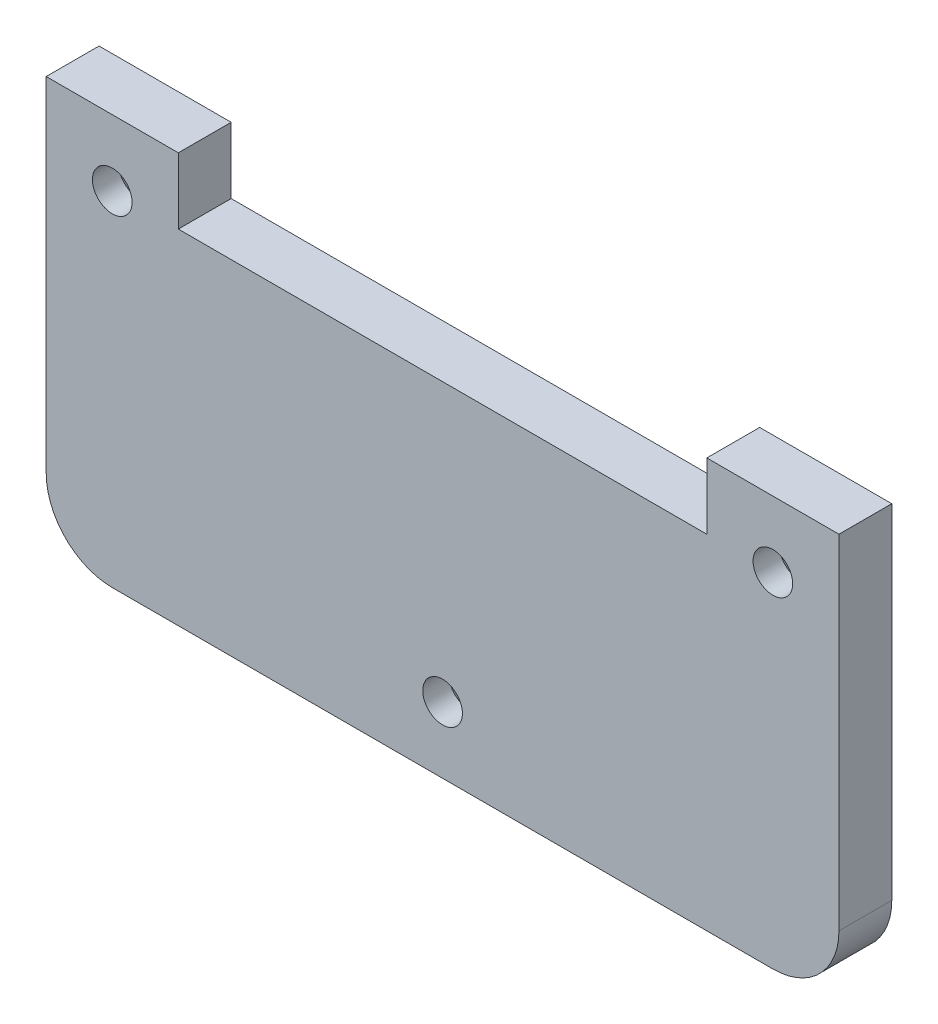
ISO-10303-21;
HEADER;
FILE_DESCRIPTION(('STEP AP214'),'2;1');
FILE_NAME('part.step','',(''),(''),'','','');
FILE_SCHEMA(('AUTOMOTIVE_DESIGN { 1 0 10303 214 1 1 1 1 }'));
ENDSEC;
DATA;
#1=APPLICATION_CONTEXT('core data for automotive mechanical design processes');
#2=APPLICATION_PROTOCOL_DEFINITION('international standard','automotive_design',2000,#1);
#3=PRODUCT_CONTEXT('',#1,'mechanical');
#4=PRODUCT('Part','Part','',(#3));
#5=PRODUCT_RELATED_PRODUCT_CATEGORY('part','',(#4));
#6=PRODUCT_DEFINITION_FORMATION('','',#4);
#7=PRODUCT_DEFINITION_CONTEXT('part definition',#1,'design');
#8=PRODUCT_DEFINITION('design','',#6,#7);
#9=PRODUCT_DEFINITION_SHAPE('','',#8);
#10=(LENGTH_UNIT() NAMED_UNIT(*) SI_UNIT(.MILLI.,.METRE.));
#11=(NAMED_UNIT(*) PLANE_ANGLE_UNIT() SI_UNIT($,.RADIAN.));
#12=(NAMED_UNIT(*) SI_UNIT($,.STERADIAN.) SOLID_ANGLE_UNIT());
#13=UNCERTAINTY_MEASURE_WITH_UNIT(LENGTH_MEASURE(1.E-05),#10,'distance_accuracy_value','');
#14=(GEOMETRIC_REPRESENTATION_CONTEXT(3) GLOBAL_UNCERTAINTY_ASSIGNED_CONTEXT((#13)) GLOBAL_UNIT_ASSIGNED_CONTEXT((#10,
#11,#12)) REPRESENTATION_CONTEXT('',''));
#15=CARTESIAN_POINT('',(0.,0.,0.));
#16=DIRECTION('',(0.,0.,1.));
#17=DIRECTION('',(1.,0.,0.));
#18=AXIS2_PLACEMENT_3D('',#15,#16,#17);
#19=CARTESIAN_POINT('',(5.,-26.,4.));
#20=DIRECTION('',(0.,0.,-1.));
#21=DIRECTION('',(-1.,0.,0.));
#22=AXIS2_PLACEMENT_3D('',#19,#20,#21);
#23=CYLINDRICAL_SURFACE('',#22,5.);
#24=CARTESIAN_POINT('',(5.,-26.,0.));
#25=DIRECTION('',(0.,0.,1.));
#26=DIRECTION('',(1.,0.,0.));
#27=AXIS2_PLACEMENT_3D('',#24,#25,#26);
#28=CIRCLE('',#27,5.);
#29=CARTESIAN_POINT('',(5.00000000000004,-31.,0.));
#30=VERTEX_POINT('',#29);
#31=CARTESIAN_POINT('',(0.,-26.,0.));
#32=VERTEX_POINT('',#31);
#33=EDGE_CURVE('E176',#30,#32,#28,.F.);
#34=ORIENTED_EDGE('',*,*,#33,.F.);
#35=DIRECTION('',(0.,0.,-1.));
#36=VECTOR('',#35,1.);
#37=CARTESIAN_POINT('',(5.00000000000004,-31.,4.));
#38=LINE('',#37,#36);
#39=CARTESIAN_POINT('',(5.00000000000004,-31.,4.));
#40=VERTEX_POINT('',#39);
#41=EDGE_CURVE('E104',#40,#30,#38,.T.);
#42=ORIENTED_EDGE('',*,*,#41,.F.);
#43=CARTESIAN_POINT('',(5.,-26.,4.));
#44=DIRECTION('',(0.,0.,1.));
#45=DIRECTION('',(1.,0.,0.));
#46=AXIS2_PLACEMENT_3D('',#43,#44,#45);
#47=CIRCLE('',#46,5.);
#48=CARTESIAN_POINT('',(0.,-26.,4.));
#49=VERTEX_POINT('',#48);
#50=EDGE_CURVE('E165',#40,#49,#47,.F.);
#51=ORIENTED_EDGE('',*,*,#50,.T.);
#52=DIRECTION('',(0.,0.,-1.));
#53=VECTOR('',#52,1.);
#54=CARTESIAN_POINT('',(0.,-26.,4.));
#55=LINE('',#54,#53);
#56=EDGE_CURVE('E100',#49,#32,#55,.T.);
#57=ORIENTED_EDGE('',*,*,#56,.T.);
#58=EDGE_LOOP('',(#34,#42,#51,#57));
#59=FACE_BOUND('',#58,.T.);
#60=ADVANCED_FACE('F41',(#59),#23,.T.);
#61=CARTESIAN_POINT('',(0.,-31.,4.));
#62=DIRECTION('',(0.,1.,0.));
#63=DIRECTION('',(0.,0.,1.));
#64=AXIS2_PLACEMENT_3D('',#61,#62,#63);
#65=PLANE('',#64);
#66=DIRECTION('',(1.,0.,0.));
#67=VECTOR('',#66,1.);
#68=CARTESIAN_POINT('',(0.,-31.,0.));
#69=LINE('',#68,#67);
#70=CARTESIAN_POINT('',(55.,-31.,0.));
#71=VERTEX_POINT('',#70);
#72=EDGE_CURVE('E180',#30,#71,#69,.T.);
#73=ORIENTED_EDGE('',*,*,#72,.T.);
#74=DIRECTION('',(0.,0.,-1.));
#75=VECTOR('',#74,1.);
#76=CARTESIAN_POINT('',(55.,-31.,4.));
#77=LINE('',#76,#75);
#78=CARTESIAN_POINT('',(55.,-31.,4.));
#79=VERTEX_POINT('',#78);
#80=EDGE_CURVE('E216',#79,#71,#77,.T.);
#81=ORIENTED_EDGE('',*,*,#80,.F.);
#82=DIRECTION('',(1.,0.,0.));
#83=VECTOR('',#82,1.);
#84=CARTESIAN_POINT('',(0.,-31.,4.));
#85=LINE('',#84,#83);
#86=EDGE_CURVE('E161',#40,#79,#85,.T.);
#87=ORIENTED_EDGE('',*,*,#86,.F.);
#88=ORIENTED_EDGE('',*,*,#41,.T.);
#89=EDGE_LOOP('',(#73,#81,#87,#88));
#90=FACE_BOUND('',#89,.T.);
#91=ADVANCED_FACE('F255',(#90),#65,.F.);
#92=CARTESIAN_POINT('',(55.,-26.,4.));
#93=DIRECTION('',(0.,0.,-1.));
#94=DIRECTION('',(-1.,0.,0.));
#95=AXIS2_PLACEMENT_3D('',#92,#93,#94);
#96=CYLINDRICAL_SURFACE('',#95,5.);
#97=CARTESIAN_POINT('',(55.,-26.,0.));
#98=DIRECTION('',(0.,0.,1.));
#99=DIRECTION('',(1.,0.,0.));
#100=AXIS2_PLACEMENT_3D('',#97,#98,#99);
#101=CIRCLE('',#100,5.);
#102=CARTESIAN_POINT('',(60.,-26.,0.));
#103=VERTEX_POINT('',#102);
#104=EDGE_CURVE('E185',#103,#71,#101,.F.);
#105=ORIENTED_EDGE('',*,*,#104,.F.);
#106=DIRECTION('',(0.,0.,-1.));
#107=VECTOR('',#106,1.);
#108=CARTESIAN_POINT('',(60.,-26.,4.));
#109=LINE('',#108,#107);
#110=CARTESIAN_POINT('',(60.,-26.,4.));
#111=VERTEX_POINT('',#110);
#112=EDGE_CURVE('E214',#111,#103,#109,.T.);
#113=ORIENTED_EDGE('',*,*,#112,.F.);
#114=CARTESIAN_POINT('',(55.,-26.,4.));
#115=DIRECTION('',(0.,0.,1.));
#116=DIRECTION('',(1.,0.,0.));
#117=AXIS2_PLACEMENT_3D('',#114,#115,#116);
#118=CIRCLE('',#117,5.);
#119=EDGE_CURVE('E157',#111,#79,#118,.F.);
#120=ORIENTED_EDGE('',*,*,#119,.T.);
#121=ORIENTED_EDGE('',*,*,#80,.T.);
#122=EDGE_LOOP('',(#105,#113,#120,#121));
#123=FACE_BOUND('',#122,.T.);
#124=ADVANCED_FACE('F260',(#123),#96,.T.);
#125=CARTESIAN_POINT('',(60.,0.,4.));
#126=DIRECTION('',(1.,0.,0.));
#127=DIRECTION('',(0.,0.,-1.));
#128=AXIS2_PLACEMENT_3D('',#125,#126,#127);
#129=PLANE('',#128);
#130=DIRECTION('',(0.,-1.,0.));
#131=VECTOR('',#130,1.);
#132=CARTESIAN_POINT('',(60.,0.,0.));
#133=LINE('',#132,#131);
#134=CARTESIAN_POINT('',(60.,0.,0.));
#135=VERTEX_POINT('',#134);
#136=EDGE_CURVE('E190',#135,#103,#133,.T.);
#137=ORIENTED_EDGE('',*,*,#136,.F.);
#138=DIRECTION('',(0.,0.,-1.));
#139=VECTOR('',#138,1.);
#140=CARTESIAN_POINT('',(60.,0.,4.));
#141=LINE('',#140,#139);
#142=CARTESIAN_POINT('',(60.,0.,4.));
#143=VERTEX_POINT('',#142);
#144=EDGE_CURVE('E212',#143,#135,#141,.T.);
#145=ORIENTED_EDGE('',*,*,#144,.F.);
#146=DIRECTION('',(0.,-1.,0.));
#147=VECTOR('',#146,1.);
#148=CARTESIAN_POINT('',(60.,0.,4.));
#149=LINE('',#148,#147);
#150=EDGE_CURVE('E153',#143,#111,#149,.T.);
#151=ORIENTED_EDGE('',*,*,#150,.T.);
#152=ORIENTED_EDGE('',*,*,#112,.T.);
#153=EDGE_LOOP('',(#137,#145,#151,#152));
#154=FACE_BOUND('',#153,.T.);
#155=ADVANCED_FACE('F317',(#154),#129,.T.);
#156=CARTESIAN_POINT('',(0.,0.,4.));
#157=DIRECTION('',(0.,1.,0.));
#158=DIRECTION('',(0.,0.,1.));
#159=AXIS2_PLACEMENT_3D('',#156,#157,#158);
#160=PLANE('',#159);
#161=DIRECTION('',(1.,0.,0.));
#162=VECTOR('',#161,1.);
#163=CARTESIAN_POINT('',(0.,0.,0.));
#164=LINE('',#163,#162);
#165=CARTESIAN_POINT('',(50.,0.,0.));
#166=VERTEX_POINT('',#165);
#167=EDGE_CURVE('E193',#166,#135,#164,.T.);
#168=ORIENTED_EDGE('',*,*,#167,.F.);
#169=DIRECTION('',(0.,0.,-1.));
#170=VECTOR('',#169,1.);
#171=CARTESIAN_POINT('',(50.,0.,4.));
#172=LINE('',#171,#170);
#173=CARTESIAN_POINT('',(50.,0.,4.));
#174=VERTEX_POINT('',#173);
#175=EDGE_CURVE('E210',#174,#166,#172,.T.);
#176=ORIENTED_EDGE('',*,*,#175,.F.);
#177=DIRECTION('',(1.,0.,0.));
#178=VECTOR('',#177,1.);
#179=CARTESIAN_POINT('',(0.,0.,4.));
#180=LINE('',#179,#178);
#181=EDGE_CURVE('E147',#174,#143,#180,.T.);
#182=ORIENTED_EDGE('',*,*,#181,.T.);
#183=ORIENTED_EDGE('',*,*,#144,.T.);
#184=EDGE_LOOP('',(#168,#176,#182,#183));
#185=FACE_BOUND('',#184,.T.);
#186=ADVANCED_FACE('F306',(#185),#160,.T.);
#187=CARTESIAN_POINT('',(50.,0.,4.));
#188=DIRECTION('',(1.,0.,0.));
#189=DIRECTION('',(0.,1.,0.));
#190=AXIS2_PLACEMENT_3D('',#187,#188,#189);
#191=PLANE('',#190);
#192=DIRECTION('',(0.,-1.,0.));
#193=VECTOR('',#192,1.);
#194=CARTESIAN_POINT('',(50.,0.,0.));
#195=LINE('',#194,#193);
#196=CARTESIAN_POINT('',(50.,-5.,0.));
#197=VERTEX_POINT('',#196);
#198=EDGE_CURVE('E196',#166,#197,#195,.T.);
#199=ORIENTED_EDGE('',*,*,#198,.T.);
#200=DIRECTION('',(0.,0.,-1.));
#201=VECTOR('',#200,1.);
#202=CARTESIAN_POINT('',(50.,-5.,4.));
#203=LINE('',#202,#201);
#204=CARTESIAN_POINT('',(50.,-5.,4.));
#205=VERTEX_POINT('',#204);
#206=EDGE_CURVE('E208',#205,#197,#203,.T.);
#207=ORIENTED_EDGE('',*,*,#206,.F.);
#208=DIRECTION('',(0.,-1.,0.));
#209=VECTOR('',#208,1.);
#210=CARTESIAN_POINT('',(50.,0.,4.));
#211=LINE('',#210,#209);
#212=EDGE_CURVE('E152',#174,#205,#211,.T.);
#213=ORIENTED_EDGE('',*,*,#212,.F.);
#214=ORIENTED_EDGE('',*,*,#175,.T.);
#215=EDGE_LOOP('',(#199,#207,#213,#214));
#216=FACE_BOUND('',#215,.T.);
#217=ADVANCED_FACE('F312',(#216),#191,.F.);
#218=CARTESIAN_POINT('',(0.,-5.00000000000002,4.));
#219=DIRECTION('',(0.,1.,0.));
#220=DIRECTION('',(-1.,0.,0.));
#221=AXIS2_PLACEMENT_3D('',#218,#219,#220);
#222=PLANE('',#221);
#223=DIRECTION('',(1.,0.,0.));
#224=VECTOR('',#223,1.);
#225=CARTESIAN_POINT('',(0.,-5.00000000000002,0.));
#226=LINE('',#225,#224);
#227=CARTESIAN_POINT('',(10.,-5.00000000000001,0.));
#228=VERTEX_POINT('',#227);
#229=EDGE_CURVE('E200',#228,#197,#226,.T.);
#230=ORIENTED_EDGE('',*,*,#229,.F.);
#231=DIRECTION('',(0.,0.,-1.));
#232=VECTOR('',#231,1.);
#233=CARTESIAN_POINT('',(10.,-5.00000000000001,4.));
#234=LINE('',#233,#232);
#235=CARTESIAN_POINT('',(10.,-5.00000000000001,4.));
#236=VERTEX_POINT('',#235);
#237=EDGE_CURVE('E137',#236,#228,#234,.T.);
#238=ORIENTED_EDGE('',*,*,#237,.F.);
#239=DIRECTION('',(1.,0.,0.));
#240=VECTOR('',#239,1.);
#241=CARTESIAN_POINT('',(0.,-5.00000000000002,4.));
#242=LINE('',#241,#240);
#243=EDGE_CURVE('E143',#236,#205,#242,.T.);
#244=ORIENTED_EDGE('',*,*,#243,.T.);
#245=ORIENTED_EDGE('',*,*,#206,.T.);
#246=EDGE_LOOP('',(#230,#238,#244,#245));
#247=FACE_BOUND('',#246,.T.);
#248=ADVANCED_FACE('F309',(#247),#222,.T.);
#249=CARTESIAN_POINT('',(10.,0.,4.));
#250=DIRECTION('',(1.,0.,0.));
#251=DIRECTION('',(0.,1.,0.));
#252=AXIS2_PLACEMENT_3D('',#249,#250,#251);
#253=PLANE('',#252);
#254=DIRECTION('',(0.,-1.,0.));
#255=VECTOR('',#254,1.);
#256=CARTESIAN_POINT('',(10.,0.,0.));
#257=LINE('',#256,#255);
#258=CARTESIAN_POINT('',(10.,0.,0.));
#259=VERTEX_POINT('',#258);
#260=EDGE_CURVE('E132',#259,#228,#257,.T.);
#261=ORIENTED_EDGE('',*,*,#260,.F.);
#262=DIRECTION('',(0.,0.,-1.));
#263=VECTOR('',#262,1.);
#264=CARTESIAN_POINT('',(10.,0.,4.));
#265=LINE('',#264,#263);
#266=CARTESIAN_POINT('',(10.,0.,4.));
#267=VERTEX_POINT('',#266);
#268=EDGE_CURVE('E127',#267,#259,#265,.T.);
#269=ORIENTED_EDGE('',*,*,#268,.F.);
#270=DIRECTION('',(0.,-1.,0.));
#271=VECTOR('',#270,1.);
#272=CARTESIAN_POINT('',(10.,0.,4.));
#273=LINE('',#272,#271);
#274=EDGE_CURVE('E130',#267,#236,#273,.T.);
#275=ORIENTED_EDGE('',*,*,#274,.T.);
#276=ORIENTED_EDGE('',*,*,#237,.T.);
#277=EDGE_LOOP('',(#261,#269,#275,#276));
#278=FACE_BOUND('',#277,.T.);
#279=ADVANCED_FACE('F129',(#278),#253,.T.);
#280=CARTESIAN_POINT('',(0.,0.,0.));
#281=VERTEX_POINT('',#280);
#282=EDGE_CURVE('E197',#281,#259,#164,.T.);
#283=ORIENTED_EDGE('',*,*,#282,.F.);
#284=DIRECTION('',(0.,0.,-1.));
#285=VECTOR('',#284,1.);
#286=CARTESIAN_POINT('',(0.,0.,4.));
#287=LINE('',#286,#285);
#288=CARTESIAN_POINT('',(0.,0.,4.));
#289=VERTEX_POINT('',#288);
#290=EDGE_CURVE('E93',#289,#281,#287,.T.);
#291=ORIENTED_EDGE('',*,*,#290,.F.);
#292=EDGE_CURVE('E141',#289,#267,#180,.T.);
#293=ORIENTED_EDGE('',*,*,#292,.T.);
#294=ORIENTED_EDGE('',*,*,#268,.T.);
#295=EDGE_LOOP('',(#283,#291,#293,#294));
#296=FACE_BOUND('',#295,.T.);
#297=ADVANCED_FACE('F145',(#296),#160,.T.);
#298=CARTESIAN_POINT('',(0.,0.,4.));
#299=DIRECTION('',(1.,0.,0.));
#300=DIRECTION('',(0.,1.,0.));
#301=AXIS2_PLACEMENT_3D('',#298,#299,#300);
#302=PLANE('',#301);
#303=DIRECTION('',(0.,-1.,0.));
#304=VECTOR('',#303,1.);
#305=CARTESIAN_POINT('',(0.,0.,0.));
#306=LINE('',#305,#304);
#307=EDGE_CURVE('E167',#281,#32,#306,.T.);
#308=ORIENTED_EDGE('',*,*,#307,.T.);
#309=ORIENTED_EDGE('',*,*,#56,.F.);
#310=DIRECTION('',(0.,-1.,0.));
#311=VECTOR('',#310,1.);
#312=CARTESIAN_POINT('',(0.,0.,4.));
#313=LINE('',#312,#311);
#314=EDGE_CURVE('E59',#289,#49,#313,.T.);
#315=ORIENTED_EDGE('',*,*,#314,.F.);
#316=ORIENTED_EDGE('',*,*,#290,.T.);
#317=EDGE_LOOP('',(#308,#309,#315,#316));
#318=FACE_BOUND('',#317,.T.);
#319=ADVANCED_FACE('F291',(#318),#302,.F.);
#320=CARTESIAN_POINT('',(0.,0.,4.));
#321=DIRECTION('',(0.,0.,1.));
#322=DIRECTION('',(1.,0.,0.));
#323=AXIS2_PLACEMENT_3D('',#320,#321,#322);
#324=PLANE('',#323);
#325=CARTESIAN_POINT('',(30.,-26.,4.));
#326=DIRECTION('',(0.,0.,1.));
#327=DIRECTION('',(1.,0.,0.));
#328=AXIS2_PLACEMENT_3D('',#325,#326,#327);
#329=CIRCLE('',#328,1.5);
#330=CARTESIAN_POINT('',(31.5,-26.,4.));
#331=VERTEX_POINT('',#330);
#332=EDGE_CURVE('E174',#331,#331,#329,.T.);
#333=ORIENTED_EDGE('',*,*,#332,.F.);
#334=EDGE_LOOP('',(#333));
#335=FACE_BOUND('',#334,.T.);
#336=CARTESIAN_POINT('',(5.,-5.00000000000001,4.));
#337=DIRECTION('',(0.,0.,1.));
#338=DIRECTION('',(1.,0.,0.));
#339=AXIS2_PLACEMENT_3D('',#336,#337,#338);
#340=CIRCLE('',#339,1.5);
#341=CARTESIAN_POINT('',(6.5,-5.00000000000001,4.));
#342=VERTEX_POINT('',#341);
#343=EDGE_CURVE('E171',#342,#342,#340,.T.);
#344=ORIENTED_EDGE('',*,*,#343,.F.);
#345=EDGE_LOOP('',(#344));
#346=FACE_BOUND('',#345,.T.);
#347=CARTESIAN_POINT('',(55.,-5.00000000000002,4.));
#348=DIRECTION('',(0.,0.,1.));
#349=DIRECTION('',(-1.,0.,0.));
#350=AXIS2_PLACEMENT_3D('',#347,#348,#349);
#351=CIRCLE('',#350,1.5);
#352=CARTESIAN_POINT('',(53.5,-5.00000000000002,4.));
#353=VERTEX_POINT('',#352);
#354=EDGE_CURVE('E168',#353,#353,#351,.T.);
#355=ORIENTED_EDGE('',*,*,#354,.F.);
#356=EDGE_LOOP('',(#355));
#357=FACE_BOUND('',#356,.T.);
#358=ORIENTED_EDGE('',*,*,#50,.F.);
#359=ORIENTED_EDGE('',*,*,#86,.T.);
#360=ORIENTED_EDGE('',*,*,#119,.F.);
#361=ORIENTED_EDGE('',*,*,#150,.F.);
#362=ORIENTED_EDGE('',*,*,#181,.F.);
#363=ORIENTED_EDGE('',*,*,#212,.T.);
#364=ORIENTED_EDGE('',*,*,#243,.F.);
#365=ORIENTED_EDGE('',*,*,#274,.F.);
#366=ORIENTED_EDGE('',*,*,#292,.F.);
#367=ORIENTED_EDGE('',*,*,#314,.T.);
#368=EDGE_LOOP('',(#358,#359,#360,#361,#362,#363,#364,#365,#366,#367));
#369=FACE_BOUND('',#368,.T.);
#370=ADVANCED_FACE('F140',(#335,#346,#357,#369),#324,.T.);
#371=CARTESIAN_POINT('',(0.,0.,0.));
#372=DIRECTION('',(0.,0.,1.));
#373=DIRECTION('',(1.,0.,0.));
#374=AXIS2_PLACEMENT_3D('',#371,#372,#373);
#375=PLANE('',#374);
#376=CARTESIAN_POINT('',(5.,-5.00000000000001,0.));
#377=DIRECTION('',(0.,0.,1.));
#378=DIRECTION('',(1.,0.,0.));
#379=AXIS2_PLACEMENT_3D('',#376,#377,#378);
#380=CIRCLE('',#379,3.5);
#381=CARTESIAN_POINT('',(8.5,-5.00000000000001,0.));
#382=VERTEX_POINT('',#381);
#383=EDGE_CURVE('E225',#382,#382,#380,.T.);
#384=ORIENTED_EDGE('',*,*,#383,.T.);
#385=EDGE_LOOP('',(#384));
#386=FACE_BOUND('',#385,.T.);
#387=CARTESIAN_POINT('',(30.,-26.,0.));
#388=DIRECTION('',(0.,0.,1.));
#389=DIRECTION('',(1.,0.,0.));
#390=AXIS2_PLACEMENT_3D('',#387,#388,#389);
#391=CIRCLE('',#390,3.5);
#392=CARTESIAN_POINT('',(33.5,-26.,0.));
#393=VERTEX_POINT('',#392);
#394=EDGE_CURVE('E222',#393,#393,#391,.T.);
#395=ORIENTED_EDGE('',*,*,#394,.T.);
#396=EDGE_LOOP('',(#395));
#397=FACE_BOUND('',#396,.T.);
#398=CARTESIAN_POINT('',(55.,-5.00000000000002,0.));
#399=DIRECTION('',(0.,0.,1.));
#400=DIRECTION('',(1.,0.,0.));
#401=AXIS2_PLACEMENT_3D('',#398,#399,#400);
#402=CIRCLE('',#401,3.5);
#403=CARTESIAN_POINT('',(58.5,-5.00000000000002,0.));
#404=VERTEX_POINT('',#403);
#405=EDGE_CURVE('E219',#404,#404,#402,.T.);
#406=ORIENTED_EDGE('',*,*,#405,.T.);
#407=EDGE_LOOP('',(#406));
#408=FACE_BOUND('',#407,.T.);
#409=ORIENTED_EDGE('',*,*,#33,.T.);
#410=ORIENTED_EDGE('',*,*,#307,.F.);
#411=ORIENTED_EDGE('',*,*,#282,.T.);
#412=ORIENTED_EDGE('',*,*,#260,.T.);
#413=ORIENTED_EDGE('',*,*,#229,.T.);
#414=ORIENTED_EDGE('',*,*,#198,.F.);
#415=ORIENTED_EDGE('',*,*,#167,.T.);
#416=ORIENTED_EDGE('',*,*,#136,.T.);
#417=ORIENTED_EDGE('',*,*,#104,.T.);
#418=ORIENTED_EDGE('',*,*,#72,.F.);
#419=EDGE_LOOP('',(#409,#410,#411,#412,#413,#414,#415,#416,#417,#418));
#420=FACE_BOUND('',#419,.T.);
#421=ADVANCED_FACE('F241',(#386,#397,#408,#420),#375,.F.);
#422=CARTESIAN_POINT('',(55.,-5.00000000000002,0.));
#423=DIRECTION('',(0.,0.,1.));
#424=DIRECTION('',(1.,0.,0.));
#425=AXIS2_PLACEMENT_3D('',#422,#423,#424);
#426=CYLINDRICAL_SURFACE('',#425,1.5);
#427=CARTESIAN_POINT('',(55.,-5.00000000000002,2.00000000000001));
#428=DIRECTION('',(0.,0.,1.));
#429=DIRECTION('',(1.,0.,0.));
#430=AXIS2_PLACEMENT_3D('',#427,#428,#429);
#431=CIRCLE('',#430,1.5);
#432=CARTESIAN_POINT('',(56.5,-5.00000000000002,2.00000000000001));
#433=VERTEX_POINT('',#432);
#434=EDGE_CURVE('E11',#433,#433,#431,.F.);
#435=ORIENTED_EDGE('',*,*,#434,.T.);
#436=EDGE_LOOP('',(#435));
#437=FACE_BOUND('',#436,.T.);
#438=ORIENTED_EDGE('',*,*,#354,.T.);
#439=EDGE_LOOP('',(#438));
#440=FACE_BOUND('',#439,.T.);
#441=ADVANCED_FACE('F244',(#437,#440),#426,.F.);
#442=CARTESIAN_POINT('',(5.,-5.00000000000001,0.));
#443=DIRECTION('',(0.,0.,1.));
#444=DIRECTION('',(1.,0.,0.));
#445=AXIS2_PLACEMENT_3D('',#442,#443,#444);
#446=CYLINDRICAL_SURFACE('',#445,1.5);
#447=CARTESIAN_POINT('',(5.,-5.00000000000001,2.00000000000001));
#448=DIRECTION('',(0.,0.,1.));
#449=DIRECTION('',(1.,0.,0.));
#450=AXIS2_PLACEMENT_3D('',#447,#448,#449);
#451=CIRCLE('',#450,1.5);
#452=CARTESIAN_POINT('',(6.5,-5.00000000000001,2.00000000000001));
#453=VERTEX_POINT('',#452);
#454=EDGE_CURVE('E228',#453,#453,#451,.F.);
#455=ORIENTED_EDGE('',*,*,#454,.T.);
#456=EDGE_LOOP('',(#455));
#457=FACE_BOUND('',#456,.T.);
#458=ORIENTED_EDGE('',*,*,#343,.T.);
#459=EDGE_LOOP('',(#458));
#460=FACE_BOUND('',#459,.T.);
#461=ADVANCED_FACE('F278',(#457,#460),#446,.F.);
#462=CARTESIAN_POINT('',(30.,-26.,0.));
#463=DIRECTION('',(0.,0.,1.));
#464=DIRECTION('',(1.,0.,0.));
#465=AXIS2_PLACEMENT_3D('',#462,#463,#464);
#466=CYLINDRICAL_SURFACE('',#465,1.5);
#467=CARTESIAN_POINT('',(30.,-26.,2.00000000000001));
#468=DIRECTION('',(0.,0.,1.));
#469=DIRECTION('',(1.,0.,0.));
#470=AXIS2_PLACEMENT_3D('',#467,#468,#469);
#471=CIRCLE('',#470,1.5);
#472=CARTESIAN_POINT('',(31.5,-26.,2.00000000000001));
#473=VERTEX_POINT('',#472);
#474=EDGE_CURVE('E51',#473,#473,#471,.F.);
#475=ORIENTED_EDGE('',*,*,#474,.T.);
#476=EDGE_LOOP('',(#475));
#477=FACE_BOUND('',#476,.T.);
#478=ORIENTED_EDGE('',*,*,#332,.T.);
#479=EDGE_LOOP('',(#478));
#480=FACE_BOUND('',#479,.T.);
#481=ADVANCED_FACE('F233',(#477,#480),#466,.F.);
#482=CARTESIAN_POINT('',(5.,-5.00000000000001,0.));
#483=DIRECTION('',(0.,0.,-1.));
#484=DIRECTION('',(-1.,0.,0.));
#485=AXIS2_PLACEMENT_3D('',#482,#483,#484);
#486=CONICAL_SURFACE('',#485,3.5,0.785398163397446);
#487=ORIENTED_EDGE('',*,*,#454,.F.);
#488=EDGE_LOOP('',(#487));
#489=FACE_BOUND('',#488,.T.);
#490=ORIENTED_EDGE('',*,*,#383,.F.);
#491=EDGE_LOOP('',(#490));
#492=FACE_BOUND('',#491,.T.);
#493=ADVANCED_FACE('F238',(#489,#492),#486,.F.);
#494=CARTESIAN_POINT('',(30.,-26.,0.));
#495=DIRECTION('',(0.,0.,-1.));
#496=DIRECTION('',(-1.,0.,0.));
#497=AXIS2_PLACEMENT_3D('',#494,#495,#496);
#498=CONICAL_SURFACE('',#497,3.5,0.785398163397445);
#499=ORIENTED_EDGE('',*,*,#474,.F.);
#500=EDGE_LOOP('',(#499));
#501=FACE_BOUND('',#500,.T.);
#502=ORIENTED_EDGE('',*,*,#394,.F.);
#503=EDGE_LOOP('',(#502));
#504=FACE_BOUND('',#503,.T.);
#505=ADVANCED_FACE('F235',(#501,#504),#498,.F.);
#506=CARTESIAN_POINT('',(55.,-5.00000000000002,0.));
#507=DIRECTION('',(0.,0.,-1.));
#508=DIRECTION('',(-1.,0.,0.));
#509=AXIS2_PLACEMENT_3D('',#506,#507,#508);
#510=CONICAL_SURFACE('',#509,3.5,0.785398163397446);
#511=ORIENTED_EDGE('',*,*,#434,.F.);
#512=EDGE_LOOP('',(#511));
#513=FACE_BOUND('',#512,.T.);
#514=ORIENTED_EDGE('',*,*,#405,.F.);
#515=EDGE_LOOP('',(#514));
#516=FACE_BOUND('',#515,.T.);
#517=ADVANCED_FACE('F44',(#513,#516),#510,.F.);
#518=CLOSED_SHELL('',(#60,#91,#124,#155,#186,#217,#248,#279,#297,#319,#370,#421,#441,#461,#481,
#493,#505,#517));
#519=MANIFOLD_SOLID_BREP('B2',#518);
#520=ADVANCED_BREP_SHAPE_REPRESENTATION('',(#18,#519),#14);
#521=SHAPE_DEFINITION_REPRESENTATION(#9,#520);
ENDSEC;
END-ISO-10303-21;
